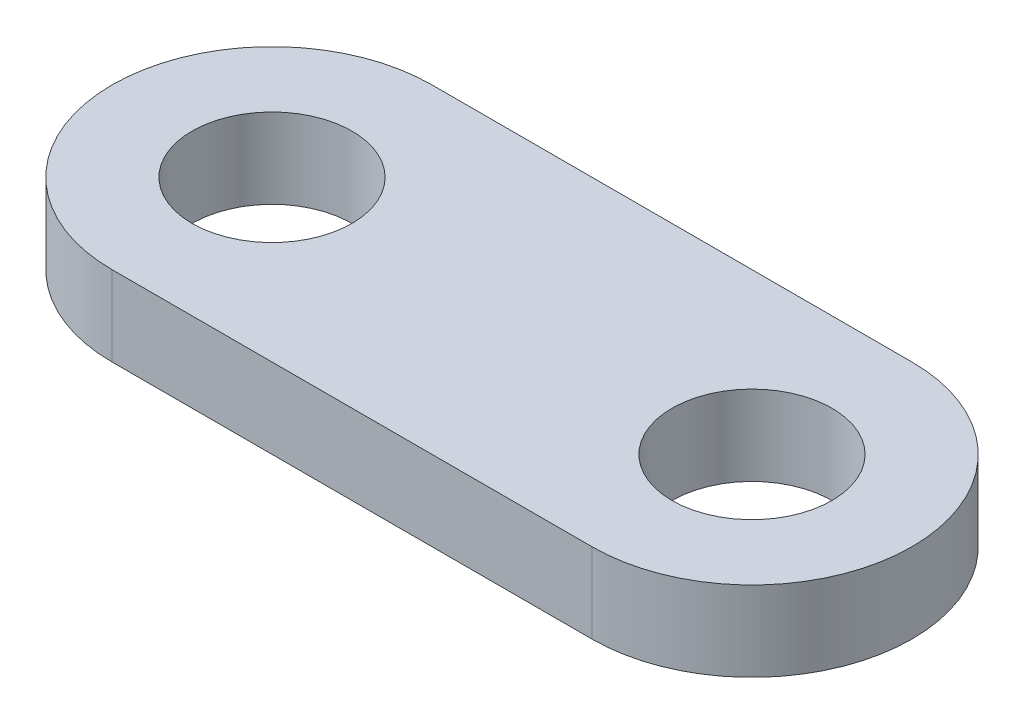
ISO-10303-21;
HEADER;
FILE_DESCRIPTION(('STEP AP214'),'2;1');
FILE_NAME('part.step','',(''),(''),'','','');
FILE_SCHEMA(('AUTOMOTIVE_DESIGN { 1 0 10303 214 1 1 1 1 }'));
ENDSEC;
DATA;
#1=APPLICATION_CONTEXT('core data for automotive mechanical design processes');
#2=APPLICATION_PROTOCOL_DEFINITION('international standard','automotive_design',2000,#1);
#3=PRODUCT_CONTEXT('',#1,'mechanical');
#4=PRODUCT('Part','Part','',(#3));
#5=PRODUCT_RELATED_PRODUCT_CATEGORY('part','',(#4));
#6=PRODUCT_DEFINITION_FORMATION('','',#4);
#7=PRODUCT_DEFINITION_CONTEXT('part definition',#1,'design');
#8=PRODUCT_DEFINITION('design','',#6,#7);
#9=PRODUCT_DEFINITION_SHAPE('','',#8);
#10=(LENGTH_UNIT() NAMED_UNIT(*) SI_UNIT(.MILLI.,.METRE.));
#11=(NAMED_UNIT(*) PLANE_ANGLE_UNIT() SI_UNIT($,.RADIAN.));
#12=(NAMED_UNIT(*) SI_UNIT($,.STERADIAN.) SOLID_ANGLE_UNIT());
#13=UNCERTAINTY_MEASURE_WITH_UNIT(LENGTH_MEASURE(1.E-05),#10,'distance_accuracy_value','');
#14=(GEOMETRIC_REPRESENTATION_CONTEXT(3) GLOBAL_UNCERTAINTY_ASSIGNED_CONTEXT((#13)) GLOBAL_UNIT_ASSIGNED_CONTEXT((#10,
#11,#12)) REPRESENTATION_CONTEXT('',''));
#15=CARTESIAN_POINT('',(0.,0.,0.));
#16=DIRECTION('',(0.,0.,1.));
#17=DIRECTION('',(1.,0.,0.));
#18=AXIS2_PLACEMENT_3D('',#15,#16,#17);
#19=CARTESIAN_POINT('',(0.,5.,0.));
#20=DIRECTION('',(0.,1.,0.));
#21=DIRECTION('',(0.,0.,1.));
#22=AXIS2_PLACEMENT_3D('',#19,#20,#21);
#23=PLANE('',#22);
#24=CARTESIAN_POINT('',(0.,5.,0.));
#25=DIRECTION('',(0.,1.,0.));
#26=DIRECTION('',(0.,0.,1.));
#27=AXIS2_PLACEMENT_3D('',#24,#25,#26);
#28=CIRCLE('',#27,5.);
#29=CARTESIAN_POINT('',(0.,5.,5.));
#30=VERTEX_POINT('',#29);
#31=EDGE_CURVE('E112',#30,#30,#28,.T.);
#32=ORIENTED_EDGE('',*,*,#31,.F.);
#33=EDGE_LOOP('',(#32));
#34=FACE_BOUND('',#33,.T.);
#35=CARTESIAN_POINT('',(0.,5.,0.));
#36=DIRECTION('',(0.,1.,0.));
#37=DIRECTION('',(0.,0.,1.));
#38=AXIS2_PLACEMENT_3D('',#35,#36,#37);
#39=CIRCLE('',#38,10.);
#40=CARTESIAN_POINT('',(0.,5.,-10.));
#41=VERTEX_POINT('',#40);
#42=CARTESIAN_POINT('',(0.,5.,10.));
#43=VERTEX_POINT('',#42);
#44=EDGE_CURVE('E92',#41,#43,#39,.T.);
#45=ORIENTED_EDGE('',*,*,#44,.T.);
#46=DIRECTION('',(1.,0.,0.));
#47=VECTOR('',#46,1.);
#48=CARTESIAN_POINT('',(0.,5.,10.));
#49=LINE('',#48,#47);
#50=CARTESIAN_POINT('',(30.,5.,10.));
#51=VERTEX_POINT('',#50);
#52=EDGE_CURVE('E87',#43,#51,#49,.T.);
#53=ORIENTED_EDGE('',*,*,#52,.T.);
#54=CARTESIAN_POINT('',(30.,5.,0.));
#55=DIRECTION('',(0.,1.,0.));
#56=DIRECTION('',(0.,0.,1.));
#57=AXIS2_PLACEMENT_3D('',#54,#55,#56);
#58=CIRCLE('',#57,10.);
#59=CARTESIAN_POINT('',(30.,5.,-10.));
#60=VERTEX_POINT('',#59);
#61=EDGE_CURVE('E90',#51,#60,#58,.T.);
#62=ORIENTED_EDGE('',*,*,#61,.T.);
#63=DIRECTION('',(-1.,0.,0.));
#64=VECTOR('',#63,1.);
#65=CARTESIAN_POINT('',(0.,5.,-10.));
#66=LINE('',#65,#64);
#67=EDGE_CURVE('E57',#60,#41,#66,.T.);
#68=ORIENTED_EDGE('',*,*,#67,.T.);
#69=EDGE_LOOP('',(#45,#53,#62,#68));
#70=FACE_BOUND('',#69,.T.);
#71=CARTESIAN_POINT('',(30.,5.,0.));
#72=DIRECTION('',(0.,1.,0.));
#73=DIRECTION('',(0.,0.,1.));
#74=AXIS2_PLACEMENT_3D('',#71,#72,#73);
#75=CIRCLE('',#74,5.);
#76=CARTESIAN_POINT('',(30.,5.,5.));
#77=VERTEX_POINT('',#76);
#78=EDGE_CURVE('E134',#77,#77,#75,.T.);
#79=ORIENTED_EDGE('',*,*,#78,.F.);
#80=EDGE_LOOP('',(#79));
#81=FACE_BOUND('',#80,.T.);
#82=ADVANCED_FACE('F39',(#34,#70,#81),#23,.T.);
#83=CARTESIAN_POINT('',(0.,0.,0.));
#84=DIRECTION('',(0.,1.,0.));
#85=DIRECTION('',(0.,0.,1.));
#86=AXIS2_PLACEMENT_3D('',#83,#84,#85);
#87=PLANE('',#86);
#88=CARTESIAN_POINT('',(0.,0.,0.));
#89=DIRECTION('',(0.,1.,0.));
#90=DIRECTION('',(0.,0.,1.));
#91=AXIS2_PLACEMENT_3D('',#88,#89,#90);
#92=CIRCLE('',#91,10.);
#93=CARTESIAN_POINT('',(0.,0.,-10.));
#94=VERTEX_POINT('',#93);
#95=CARTESIAN_POINT('',(0.,0.,10.));
#96=VERTEX_POINT('',#95);
#97=EDGE_CURVE('E108',#94,#96,#92,.T.);
#98=ORIENTED_EDGE('',*,*,#97,.F.);
#99=DIRECTION('',(-1.,0.,0.));
#100=VECTOR('',#99,1.);
#101=CARTESIAN_POINT('',(0.,0.,-10.));
#102=LINE('',#101,#100);
#103=CARTESIAN_POINT('',(30.,0.,-10.));
#104=VERTEX_POINT('',#103);
#105=EDGE_CURVE('E80',#104,#94,#102,.T.);
#106=ORIENTED_EDGE('',*,*,#105,.F.);
#107=CARTESIAN_POINT('',(30.,0.,0.));
#108=DIRECTION('',(0.,1.,0.));
#109=DIRECTION('',(0.,0.,1.));
#110=AXIS2_PLACEMENT_3D('',#107,#108,#109);
#111=CIRCLE('',#110,10.);
#112=CARTESIAN_POINT('',(30.,0.,10.));
#113=VERTEX_POINT('',#112);
#114=EDGE_CURVE('E74',#113,#104,#111,.T.);
#115=ORIENTED_EDGE('',*,*,#114,.F.);
#116=DIRECTION('',(1.,0.,0.));
#117=VECTOR('',#116,1.);
#118=CARTESIAN_POINT('',(0.,0.,10.));
#119=LINE('',#118,#117);
#120=EDGE_CURVE('E97',#96,#113,#119,.T.);
#121=ORIENTED_EDGE('',*,*,#120,.F.);
#122=EDGE_LOOP('',(#98,#106,#115,#121));
#123=FACE_BOUND('',#122,.T.);
#124=CARTESIAN_POINT('',(0.,0.,0.));
#125=DIRECTION('',(0.,1.,0.));
#126=DIRECTION('',(0.,0.,1.));
#127=AXIS2_PLACEMENT_3D('',#124,#125,#126);
#128=CIRCLE('',#127,5.);
#129=CARTESIAN_POINT('',(0.,0.,5.));
#130=VERTEX_POINT('',#129);
#131=EDGE_CURVE('E130',#130,#130,#128,.T.);
#132=ORIENTED_EDGE('',*,*,#131,.T.);
#133=EDGE_LOOP('',(#132));
#134=FACE_BOUND('',#133,.T.);
#135=CARTESIAN_POINT('',(30.,0.,0.));
#136=DIRECTION('',(0.,1.,0.));
#137=DIRECTION('',(0.,0.,1.));
#138=AXIS2_PLACEMENT_3D('',#135,#136,#137);
#139=CIRCLE('',#138,5.);
#140=CARTESIAN_POINT('',(30.,0.,5.));
#141=VERTEX_POINT('',#140);
#142=EDGE_CURVE('E138',#141,#141,#139,.T.);
#143=ORIENTED_EDGE('',*,*,#142,.T.);
#144=EDGE_LOOP('',(#143));
#145=FACE_BOUND('',#144,.T.);
#146=ADVANCED_FACE('F125',(#123,#134,#145),#87,.F.);
#147=CARTESIAN_POINT('',(0.,5.,0.));
#148=DIRECTION('',(0.,-1.,0.));
#149=DIRECTION('',(0.,0.,-1.));
#150=AXIS2_PLACEMENT_3D('',#147,#148,#149);
#151=CYLINDRICAL_SURFACE('',#150,10.);
#152=ORIENTED_EDGE('',*,*,#97,.T.);
#153=DIRECTION('',(0.,-1.,0.));
#154=VECTOR('',#153,1.);
#155=CARTESIAN_POINT('',(0.,5.,10.));
#156=LINE('',#155,#154);
#157=EDGE_CURVE('E11',#43,#96,#156,.T.);
#158=ORIENTED_EDGE('',*,*,#157,.F.);
#159=ORIENTED_EDGE('',*,*,#44,.F.);
#160=DIRECTION('',(0.,-1.,0.));
#161=VECTOR('',#160,1.);
#162=CARTESIAN_POINT('',(0.,5.,-10.));
#163=LINE('',#162,#161);
#164=EDGE_CURVE('E104',#41,#94,#163,.T.);
#165=ORIENTED_EDGE('',*,*,#164,.T.);
#166=EDGE_LOOP('',(#152,#158,#159,#165));
#167=FACE_BOUND('',#166,.T.);
#168=ADVANCED_FACE('F41',(#167),#151,.T.);
#169=CARTESIAN_POINT('',(0.,5.,10.));
#170=DIRECTION('',(0.,0.,-1.));
#171=DIRECTION('',(-1.,0.,0.));
#172=AXIS2_PLACEMENT_3D('',#169,#170,#171);
#173=PLANE('',#172);
#174=ORIENTED_EDGE('',*,*,#120,.T.);
#175=DIRECTION('',(0.,-1.,0.));
#176=VECTOR('',#175,1.);
#177=CARTESIAN_POINT('',(30.,5.,10.));
#178=LINE('',#177,#176);
#179=EDGE_CURVE('E49',#51,#113,#178,.T.);
#180=ORIENTED_EDGE('',*,*,#179,.F.);
#181=ORIENTED_EDGE('',*,*,#52,.F.);
#182=ORIENTED_EDGE('',*,*,#157,.T.);
#183=EDGE_LOOP('',(#174,#180,#181,#182));
#184=FACE_BOUND('',#183,.T.);
#185=ADVANCED_FACE('F96',(#184),#173,.F.);
#186=CARTESIAN_POINT('',(30.,5.,0.));
#187=DIRECTION('',(0.,-1.,0.));
#188=DIRECTION('',(0.,0.,-1.));
#189=AXIS2_PLACEMENT_3D('',#186,#187,#188);
#190=CYLINDRICAL_SURFACE('',#189,10.);
#191=ORIENTED_EDGE('',*,*,#114,.T.);
#192=DIRECTION('',(0.,-1.,0.));
#193=VECTOR('',#192,1.);
#194=CARTESIAN_POINT('',(30.,5.,-10.));
#195=LINE('',#194,#193);
#196=EDGE_CURVE('E99',#60,#104,#195,.T.);
#197=ORIENTED_EDGE('',*,*,#196,.F.);
#198=ORIENTED_EDGE('',*,*,#61,.F.);
#199=ORIENTED_EDGE('',*,*,#179,.T.);
#200=EDGE_LOOP('',(#191,#197,#198,#199));
#201=FACE_BOUND('',#200,.T.);
#202=ADVANCED_FACE('F100',(#201),#190,.T.);
#203=CARTESIAN_POINT('',(0.,5.,-10.));
#204=DIRECTION('',(0.,0.,1.));
#205=DIRECTION('',(1.,0.,0.));
#206=AXIS2_PLACEMENT_3D('',#203,#204,#205);
#207=PLANE('',#206);
#208=ORIENTED_EDGE('',*,*,#105,.T.);
#209=ORIENTED_EDGE('',*,*,#164,.F.);
#210=ORIENTED_EDGE('',*,*,#67,.F.);
#211=ORIENTED_EDGE('',*,*,#196,.T.);
#212=EDGE_LOOP('',(#208,#209,#210,#211));
#213=FACE_BOUND('',#212,.T.);
#214=ADVANCED_FACE('F122',(#213),#207,.F.);
#215=CARTESIAN_POINT('',(0.,5.,0.));
#216=DIRECTION('',(0.,-1.,0.));
#217=DIRECTION('',(0.,0.,-1.));
#218=AXIS2_PLACEMENT_3D('',#215,#216,#217);
#219=CYLINDRICAL_SURFACE('',#218,5.);
#220=ORIENTED_EDGE('',*,*,#31,.T.);
#221=EDGE_LOOP('',(#220));
#222=FACE_BOUND('',#221,.T.);
#223=ORIENTED_EDGE('',*,*,#131,.F.);
#224=EDGE_LOOP('',(#223));
#225=FACE_BOUND('',#224,.T.);
#226=ADVANCED_FACE('F157',(#222,#225),#219,.F.);
#227=CARTESIAN_POINT('',(30.,5.,0.));
#228=DIRECTION('',(0.,-1.,0.));
#229=DIRECTION('',(0.,0.,-1.));
#230=AXIS2_PLACEMENT_3D('',#227,#228,#229);
#231=CYLINDRICAL_SURFACE('',#230,5.);
#232=ORIENTED_EDGE('',*,*,#78,.T.);
#233=EDGE_LOOP('',(#232));
#234=FACE_BOUND('',#233,.T.);
#235=ORIENTED_EDGE('',*,*,#142,.F.);
#236=EDGE_LOOP('',(#235));
#237=FACE_BOUND('',#236,.T.);
#238=ADVANCED_FACE('F146',(#234,#237),#231,.F.);
#239=CLOSED_SHELL('',(#82,#146,#168,#185,#202,#214,#226,#238));
#240=MANIFOLD_SOLID_BREP('B2',#239);
#241=ADVANCED_BREP_SHAPE_REPRESENTATION('',(#18,#240),#14);
#242=SHAPE_DEFINITION_REPRESENTATION(#9,#241);
ENDSEC;
END-ISO-10303-21;
